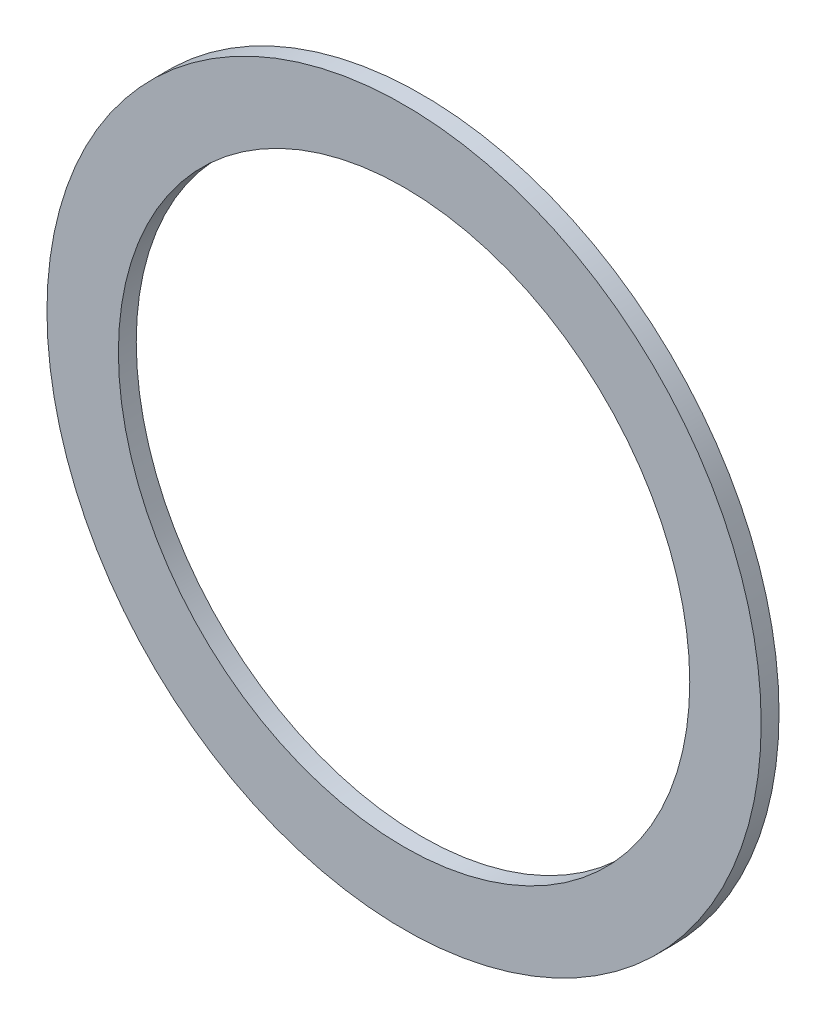
ISO-10303-21;
HEADER;
FILE_DESCRIPTION(('STEP AP214'),'2;1');
FILE_NAME('part.step','',(''),(''),'','','');
FILE_SCHEMA(('AUTOMOTIVE_DESIGN { 1 0 10303 214 1 1 1 1 }'));
ENDSEC;
DATA;
#1=APPLICATION_CONTEXT('core data for automotive mechanical design processes');
#2=APPLICATION_PROTOCOL_DEFINITION('international standard','automotive_design',2000,#1);
#3=PRODUCT_CONTEXT('',#1,'mechanical');
#4=PRODUCT('Part','Part','',(#3));
#5=PRODUCT_RELATED_PRODUCT_CATEGORY('part','',(#4));
#6=PRODUCT_DEFINITION_FORMATION('','',#4);
#7=PRODUCT_DEFINITION_CONTEXT('part definition',#1,'design');
#8=PRODUCT_DEFINITION('design','',#6,#7);
#9=PRODUCT_DEFINITION_SHAPE('','',#8);
#10=(LENGTH_UNIT() NAMED_UNIT(*) SI_UNIT(.MILLI.,.METRE.));
#11=(NAMED_UNIT(*) PLANE_ANGLE_UNIT() SI_UNIT($,.RADIAN.));
#12=(NAMED_UNIT(*) SI_UNIT($,.STERADIAN.) SOLID_ANGLE_UNIT());
#13=UNCERTAINTY_MEASURE_WITH_UNIT(LENGTH_MEASURE(1.E-05),#10,'distance_accuracy_value','');
#14=(GEOMETRIC_REPRESENTATION_CONTEXT(3) GLOBAL_UNCERTAINTY_ASSIGNED_CONTEXT((#13)) GLOBAL_UNIT_ASSIGNED_CONTEXT((#10,
#11,#12)) REPRESENTATION_CONTEXT('',''));
#15=CARTESIAN_POINT('',(0.,0.,0.));
#16=DIRECTION('',(0.,0.,1.));
#17=DIRECTION('',(1.,0.,0.));
#18=AXIS2_PLACEMENT_3D('',#15,#16,#17);
#19=CARTESIAN_POINT('',(-10.0000001490116,1.00000001490116,2.));
#20=DIRECTION('',(0.,0.,1.));
#21=DIRECTION('',(1.,0.,0.));
#22=AXIS2_PLACEMENT_3D('',#19,#20,#21);
#23=PLANE('',#22);
#24=CARTESIAN_POINT('',(-10.0000001490116,1.00000001490116,2.));
#25=DIRECTION('',(0.,0.,-1.));
#26=DIRECTION('',(-1.,0.,0.));
#27=AXIS2_PLACEMENT_3D('',#24,#25,#26);
#28=CIRCLE('',#27,1.60000002980232);
#29=CARTESIAN_POINT('',(-8.40000011920929,1.00000001490116,2.));
#30=VERTEX_POINT('',#29);
#31=EDGE_CURVE('E52',#30,#30,#28,.T.);
#32=ORIENTED_EDGE('',*,*,#31,.F.);
#33=EDGE_LOOP('',(#32));
#34=FACE_BOUND('',#33,.T.);
#35=CARTESIAN_POINT('',(-10.0000001490116,1.00000001490116,2.));
#36=DIRECTION('',(0.,0.,1.));
#37=DIRECTION('',(-1.,0.,0.));
#38=AXIS2_PLACEMENT_3D('',#35,#36,#37);
#39=CIRCLE('',#38,2.00000002980232);
#40=CARTESIAN_POINT('',(-8.00000011920929,1.00000001490116,2.));
#41=VERTEX_POINT('',#40);
#42=EDGE_CURVE('E11',#41,#41,#39,.T.);
#43=ORIENTED_EDGE('',*,*,#42,.F.);
#44=EDGE_LOOP('',(#43));
#45=FACE_BOUND('',#44,.T.);
#46=ADVANCED_FACE('F17',(#34,#45),#23,.F.);
#47=CARTESIAN_POINT('',(-10.0000001490116,1.00000001490116,2.1));
#48=DIRECTION('',(0.,0.,1.));
#49=DIRECTION('',(1.,0.,0.));
#50=AXIS2_PLACEMENT_3D('',#47,#48,#49);
#51=PLANE('',#50);
#52=CARTESIAN_POINT('',(-10.0000001490116,1.00000001490116,2.1));
#53=DIRECTION('',(0.,0.,-1.));
#54=DIRECTION('',(-1.,0.,0.));
#55=AXIS2_PLACEMENT_3D('',#52,#53,#54);
#56=CIRCLE('',#55,1.60000002980232);
#57=CARTESIAN_POINT('',(-8.40000011920929,1.00000001490116,2.1));
#58=VERTEX_POINT('',#57);
#59=EDGE_CURVE('E64',#58,#58,#56,.T.);
#60=ORIENTED_EDGE('',*,*,#59,.T.);
#61=EDGE_LOOP('',(#60));
#62=FACE_BOUND('',#61,.T.);
#63=CARTESIAN_POINT('',(-10.0000001490116,1.00000001490116,2.1));
#64=DIRECTION('',(0.,0.,1.));
#65=DIRECTION('',(-1.,0.,0.));
#66=AXIS2_PLACEMENT_3D('',#63,#64,#65);
#67=CIRCLE('',#66,2.00000002980232);
#68=CARTESIAN_POINT('',(-8.00000011920929,1.00000001490116,2.1));
#69=VERTEX_POINT('',#68);
#70=EDGE_CURVE('E56',#69,#69,#67,.T.);
#71=ORIENTED_EDGE('',*,*,#70,.T.);
#72=EDGE_LOOP('',(#71));
#73=FACE_BOUND('',#72,.T.);
#74=ADVANCED_FACE('F70',(#62,#73),#51,.T.);
#75=CARTESIAN_POINT('',(-10.0000001490116,1.00000001490116,2.));
#76=DIRECTION('',(0.,0.,1.));
#77=DIRECTION('',(-1.,0.,0.));
#78=AXIS2_PLACEMENT_3D('',#75,#76,#77);
#79=CYLINDRICAL_SURFACE('',#78,2.00000002980232);
#80=ORIENTED_EDGE('',*,*,#70,.F.);
#81=DIRECTION('',(0.,0.,-1.));
#82=VECTOR('',#81,1.);
#83=CARTESIAN_POINT('',(-8.00000011920929,1.00000001490116,2.));
#84=LINE('',#83,#82);
#85=EDGE_CURVE('E27',#69,#41,#84,.T.);
#86=ORIENTED_EDGE('',*,*,#85,.T.);
#87=ORIENTED_EDGE('',*,*,#42,.T.);
#88=ORIENTED_EDGE('',*,*,#85,.F.);
#89=EDGE_LOOP('',(#80,#86,#87,#88));
#90=FACE_BOUND('',#89,.T.);
#91=ADVANCED_FACE('F73',(#90),#79,.T.);
#92=CARTESIAN_POINT('',(-10.0000001490116,1.00000001490116,2.));
#93=DIRECTION('',(0.,0.,1.));
#94=DIRECTION('',(-1.,0.,0.));
#95=AXIS2_PLACEMENT_3D('',#92,#93,#94);
#96=CYLINDRICAL_SURFACE('',#95,1.60000002980232);
#97=ORIENTED_EDGE('',*,*,#59,.F.);
#98=DIRECTION('',(0.,0.,-1.));
#99=VECTOR('',#98,1.);
#100=CARTESIAN_POINT('',(-8.40000011920929,1.00000001490116,2.));
#101=LINE('',#100,#99);
#102=EDGE_CURVE('E20',#58,#30,#101,.T.);
#103=ORIENTED_EDGE('',*,*,#102,.T.);
#104=ORIENTED_EDGE('',*,*,#31,.T.);
#105=ORIENTED_EDGE('',*,*,#102,.F.);
#106=EDGE_LOOP('',(#97,#103,#104,#105));
#107=FACE_BOUND('',#106,.T.);
#108=ADVANCED_FACE('F53',(#107),#96,.F.);
#109=CLOSED_SHELL('',(#46,#74,#91,#108));
#110=MANIFOLD_SOLID_BREP('B1',#109);
#111=ADVANCED_BREP_SHAPE_REPRESENTATION('',(#18,#110),#14);
#112=SHAPE_DEFINITION_REPRESENTATION(#9,#111);
ENDSEC;
END-ISO-10303-21;
